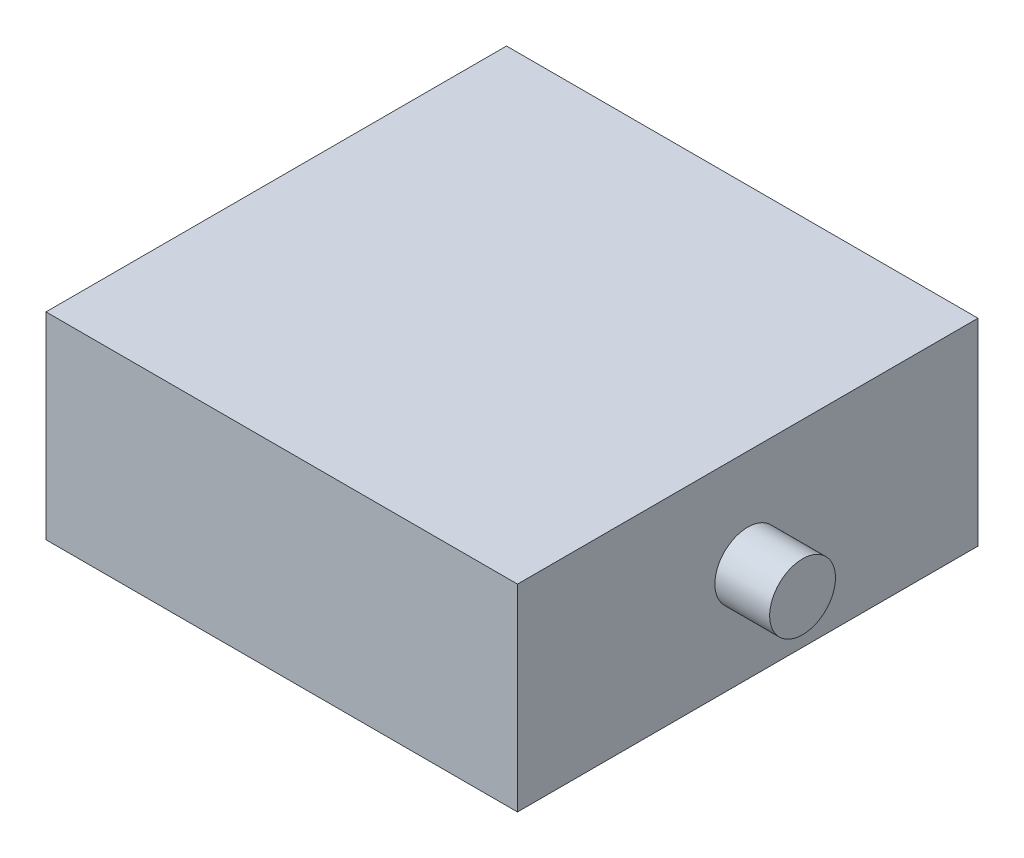
ISO-10303-21;
HEADER;
FILE_DESCRIPTION(('STEP AP214'),'2;1');
FILE_NAME('part.step','',(''),(''),'','','');
FILE_SCHEMA(('AUTOMOTIVE_DESIGN { 1 0 10303 214 1 1 1 1 }'));
ENDSEC;
DATA;
#1=APPLICATION_CONTEXT('core data for automotive mechanical design processes');
#2=APPLICATION_PROTOCOL_DEFINITION('international standard','automotive_design',2000,#1);
#3=PRODUCT_CONTEXT('',#1,'mechanical');
#4=PRODUCT('Part','Part','',(#3));
#5=PRODUCT_RELATED_PRODUCT_CATEGORY('part','',(#4));
#6=PRODUCT_DEFINITION_FORMATION('','',#4);
#7=PRODUCT_DEFINITION_CONTEXT('part definition',#1,'design');
#8=PRODUCT_DEFINITION('design','',#6,#7);
#9=PRODUCT_DEFINITION_SHAPE('','',#8);
#10=(LENGTH_UNIT() NAMED_UNIT(*) SI_UNIT(.MILLI.,.METRE.));
#11=(NAMED_UNIT(*) PLANE_ANGLE_UNIT() SI_UNIT($,.RADIAN.));
#12=(NAMED_UNIT(*) SI_UNIT($,.STERADIAN.) SOLID_ANGLE_UNIT());
#13=UNCERTAINTY_MEASURE_WITH_UNIT(LENGTH_MEASURE(1.E-05),#10,'distance_accuracy_value','');
#14=(GEOMETRIC_REPRESENTATION_CONTEXT(3) GLOBAL_UNCERTAINTY_ASSIGNED_CONTEXT((#13)) GLOBAL_UNIT_ASSIGNED_CONTEXT((#10,
#11,#12)) REPRESENTATION_CONTEXT('',''));
#15=CARTESIAN_POINT('',(0.,0.,0.));
#16=DIRECTION('',(0.,0.,1.));
#17=DIRECTION('',(1.,0.,0.));
#18=AXIS2_PLACEMENT_3D('',#15,#16,#17);
#19=CARTESIAN_POINT('',(0.,18.,-42.));
#20=DIRECTION('',(1.,0.,0.));
#21=DIRECTION('',(0.,0.,-1.));
#22=AXIS2_PLACEMENT_3D('',#19,#20,#21);
#23=PLANE('',#22);
#24=DIRECTION('',(0.,0.,1.));
#25=VECTOR('',#24,1.);
#26=CARTESIAN_POINT('',(0.,0.,-42.));
#27=LINE('',#26,#25);
#28=CARTESIAN_POINT('',(0.,0.,-42.));
#29=VERTEX_POINT('',#28);
#30=CARTESIAN_POINT('',(0.,0.,0.));
#31=VERTEX_POINT('',#30);
#32=EDGE_CURVE('E108',#29,#31,#27,.T.);
#33=ORIENTED_EDGE('',*,*,#32,.T.);
#34=DIRECTION('',(0.,-1.,0.));
#35=VECTOR('',#34,1.);
#36=CARTESIAN_POINT('',(0.,18.,0.));
#37=LINE('',#36,#35);
#38=CARTESIAN_POINT('',(0.,18.,0.));
#39=VERTEX_POINT('',#38);
#40=EDGE_CURVE('E12',#39,#31,#37,.T.);
#41=ORIENTED_EDGE('',*,*,#40,.F.);
#42=DIRECTION('',(0.,0.,1.));
#43=VECTOR('',#42,1.);
#44=CARTESIAN_POINT('',(0.,18.,-42.));
#45=LINE('',#44,#43);
#46=CARTESIAN_POINT('',(0.,18.,-42.));
#47=VERTEX_POINT('',#46);
#48=EDGE_CURVE('E102',#47,#39,#45,.T.);
#49=ORIENTED_EDGE('',*,*,#48,.F.);
#50=DIRECTION('',(0.,-1.,0.));
#51=VECTOR('',#50,1.);
#52=CARTESIAN_POINT('',(0.,18.,-42.));
#53=LINE('',#52,#51);
#54=EDGE_CURVE('E62',#47,#29,#53,.T.);
#55=ORIENTED_EDGE('',*,*,#54,.T.);
#56=EDGE_LOOP('',(#33,#41,#49,#55));
#57=FACE_BOUND('',#56,.T.);
#58=ADVANCED_FACE('F54',(#57),#23,.F.);
#59=CARTESIAN_POINT('',(0.,18.,0.));
#60=DIRECTION('',(0.,0.,-1.));
#61=DIRECTION('',(-1.,0.,0.));
#62=AXIS2_PLACEMENT_3D('',#59,#60,#61);
#63=PLANE('',#62);
#64=DIRECTION('',(1.,0.,0.));
#65=VECTOR('',#64,1.);
#66=CARTESIAN_POINT('',(0.,0.,0.));
#67=LINE('',#66,#65);
#68=CARTESIAN_POINT('',(43.,0.,0.));
#69=VERTEX_POINT('',#68);
#70=EDGE_CURVE('E103',#31,#69,#67,.T.);
#71=ORIENTED_EDGE('',*,*,#70,.T.);
#72=DIRECTION('',(0.,-1.,0.));
#73=VECTOR('',#72,1.);
#74=CARTESIAN_POINT('',(43.,18.,0.));
#75=LINE('',#74,#73);
#76=CARTESIAN_POINT('',(43.,18.,0.));
#77=VERTEX_POINT('',#76);
#78=EDGE_CURVE('E69',#77,#69,#75,.T.);
#79=ORIENTED_EDGE('',*,*,#78,.F.);
#80=DIRECTION('',(1.,0.,0.));
#81=VECTOR('',#80,1.);
#82=CARTESIAN_POINT('',(0.,18.,0.));
#83=LINE('',#82,#81);
#84=EDGE_CURVE('E122',#39,#77,#83,.T.);
#85=ORIENTED_EDGE('',*,*,#84,.F.);
#86=ORIENTED_EDGE('',*,*,#40,.T.);
#87=EDGE_LOOP('',(#71,#79,#85,#86));
#88=FACE_BOUND('',#87,.T.);
#89=ADVANCED_FACE('F153',(#88),#63,.F.);
#90=CARTESIAN_POINT('',(48.,18.,-42.));
#91=DIRECTION('',(0.,0.,1.));
#92=DIRECTION('',(1.,0.,0.));
#93=AXIS2_PLACEMENT_3D('',#90,#91,#92);
#94=PLANE('',#93);
#95=DIRECTION('',(-1.,0.,0.));
#96=VECTOR('',#95,1.);
#97=CARTESIAN_POINT('',(48.,18.,-42.));
#98=LINE('',#97,#96);
#99=CARTESIAN_POINT('',(43.,18.,-42.));
#100=VERTEX_POINT('',#99);
#101=EDGE_CURVE('E78',#100,#47,#98,.T.);
#102=ORIENTED_EDGE('',*,*,#101,.F.);
#103=DIRECTION('',(0.,-1.,0.));
#104=VECTOR('',#103,1.);
#105=CARTESIAN_POINT('',(43.,18.,-42.));
#106=LINE('',#105,#104);
#107=CARTESIAN_POINT('',(43.,0.,-42.));
#108=VERTEX_POINT('',#107);
#109=EDGE_CURVE('E98',#100,#108,#106,.T.);
#110=ORIENTED_EDGE('',*,*,#109,.T.);
#111=DIRECTION('',(-1.,0.,0.));
#112=VECTOR('',#111,1.);
#113=CARTESIAN_POINT('',(48.,0.,-42.));
#114=LINE('',#113,#112);
#115=EDGE_CURVE('E92',#108,#29,#114,.T.);
#116=ORIENTED_EDGE('',*,*,#115,.T.);
#117=ORIENTED_EDGE('',*,*,#54,.F.);
#118=EDGE_LOOP('',(#102,#110,#116,#117));
#119=FACE_BOUND('',#118,.T.);
#120=ADVANCED_FACE('F94',(#119),#94,.F.);
#121=CARTESIAN_POINT('',(0.,18.,0.));
#122=DIRECTION('',(0.,1.,0.));
#123=DIRECTION('',(0.,0.,1.));
#124=AXIS2_PLACEMENT_3D('',#121,#122,#123);
#125=PLANE('',#124);
#126=DIRECTION('',(0.,0.,-1.));
#127=VECTOR('',#126,1.);
#128=CARTESIAN_POINT('',(43.,18.,0.));
#129=LINE('',#128,#127);
#130=EDGE_CURVE('E117',#77,#100,#129,.T.);
#131=ORIENTED_EDGE('',*,*,#130,.T.);
#132=ORIENTED_EDGE('',*,*,#101,.T.);
#133=ORIENTED_EDGE('',*,*,#48,.T.);
#134=ORIENTED_EDGE('',*,*,#84,.T.);
#135=EDGE_LOOP('',(#131,#132,#133,#134));
#136=FACE_BOUND('',#135,.T.);
#137=ADVANCED_FACE('F154',(#136),#125,.T.);
#138=CARTESIAN_POINT('',(0.,0.,0.));
#139=DIRECTION('',(0.,1.,0.));
#140=DIRECTION('',(0.,0.,1.));
#141=AXIS2_PLACEMENT_3D('',#138,#139,#140);
#142=PLANE('',#141);
#143=ORIENTED_EDGE('',*,*,#115,.F.);
#144=DIRECTION('',(0.,0.,-1.));
#145=VECTOR('',#144,1.);
#146=CARTESIAN_POINT('',(43.,0.,0.));
#147=LINE('',#146,#145);
#148=EDGE_CURVE('E132',#69,#108,#147,.T.);
#149=ORIENTED_EDGE('',*,*,#148,.F.);
#150=ORIENTED_EDGE('',*,*,#70,.F.);
#151=ORIENTED_EDGE('',*,*,#32,.F.);
#152=EDGE_LOOP('',(#143,#149,#150,#151));
#153=FACE_BOUND('',#152,.T.);
#154=ADVANCED_FACE('F110',(#153),#142,.F.);
#155=CARTESIAN_POINT('',(43.,0.,0.));
#156=DIRECTION('',(-1.,0.,0.));
#157=DIRECTION('',(0.,0.,1.));
#158=AXIS2_PLACEMENT_3D('',#155,#156,#157);
#159=PLANE('',#158);
#160=CARTESIAN_POINT('',(43.,9.,-21.));
#161=DIRECTION('',(1.,0.,0.));
#162=DIRECTION('',(0.,0.,-1.));
#163=AXIS2_PLACEMENT_3D('',#160,#161,#162);
#164=CIRCLE('',#163,3.);
#165=CARTESIAN_POINT('',(43.,9.,-24.));
#166=VERTEX_POINT('',#165);
#167=EDGE_CURVE('E135',#166,#166,#164,.T.);
#168=ORIENTED_EDGE('',*,*,#167,.F.);
#169=EDGE_LOOP('',(#168));
#170=FACE_BOUND('',#169,.T.);
#171=ORIENTED_EDGE('',*,*,#148,.T.);
#172=ORIENTED_EDGE('',*,*,#109,.F.);
#173=ORIENTED_EDGE('',*,*,#130,.F.);
#174=ORIENTED_EDGE('',*,*,#78,.T.);
#175=EDGE_LOOP('',(#171,#172,#173,#174));
#176=FACE_BOUND('',#175,.T.);
#177=ADVANCED_FACE('F147',(#170,#176),#159,.F.);
#178=CARTESIAN_POINT('',(43.,9.,-21.));
#179=DIRECTION('',(1.,0.,0.));
#180=DIRECTION('',(0.,0.,-1.));
#181=AXIS2_PLACEMENT_3D('',#178,#179,#180);
#182=CYLINDRICAL_SURFACE('',#181,3.);
#183=ORIENTED_EDGE('',*,*,#167,.T.);
#184=EDGE_LOOP('',(#183));
#185=FACE_BOUND('',#184,.T.);
#186=CARTESIAN_POINT('',(48.,9.,-21.));
#187=DIRECTION('',(1.,0.,0.));
#188=DIRECTION('',(0.,0.,-1.));
#189=AXIS2_PLACEMENT_3D('',#186,#187,#188);
#190=CIRCLE('',#189,3.);
#191=CARTESIAN_POINT('',(48.,9.,-24.));
#192=VERTEX_POINT('',#191);
#193=EDGE_CURVE('E136',#192,#192,#190,.T.);
#194=ORIENTED_EDGE('',*,*,#193,.F.);
#195=EDGE_LOOP('',(#194));
#196=FACE_BOUND('',#195,.T.);
#197=ADVANCED_FACE('F144',(#185,#196),#182,.T.);
#198=CARTESIAN_POINT('',(48.,18.,0.));
#199=DIRECTION('',(-1.,0.,0.));
#200=DIRECTION('',(0.,0.,1.));
#201=AXIS2_PLACEMENT_3D('',#198,#199,#200);
#202=PLANE('',#201);
#203=ORIENTED_EDGE('',*,*,#193,.T.);
#204=EDGE_LOOP('',(#203));
#205=FACE_BOUND('',#204,.T.);
#206=ADVANCED_FACE('F170',(#205),#202,.F.);
#207=CLOSED_SHELL('',(#58,#89,#120,#137,#154,#177,#197,#206));
#208=MANIFOLD_SOLID_BREP('B2',#207);
#209=ADVANCED_BREP_SHAPE_REPRESENTATION('',(#18,#208),#14);
#210=SHAPE_DEFINITION_REPRESENTATION(#9,#209);
ENDSEC;
END-ISO-10303-21;
